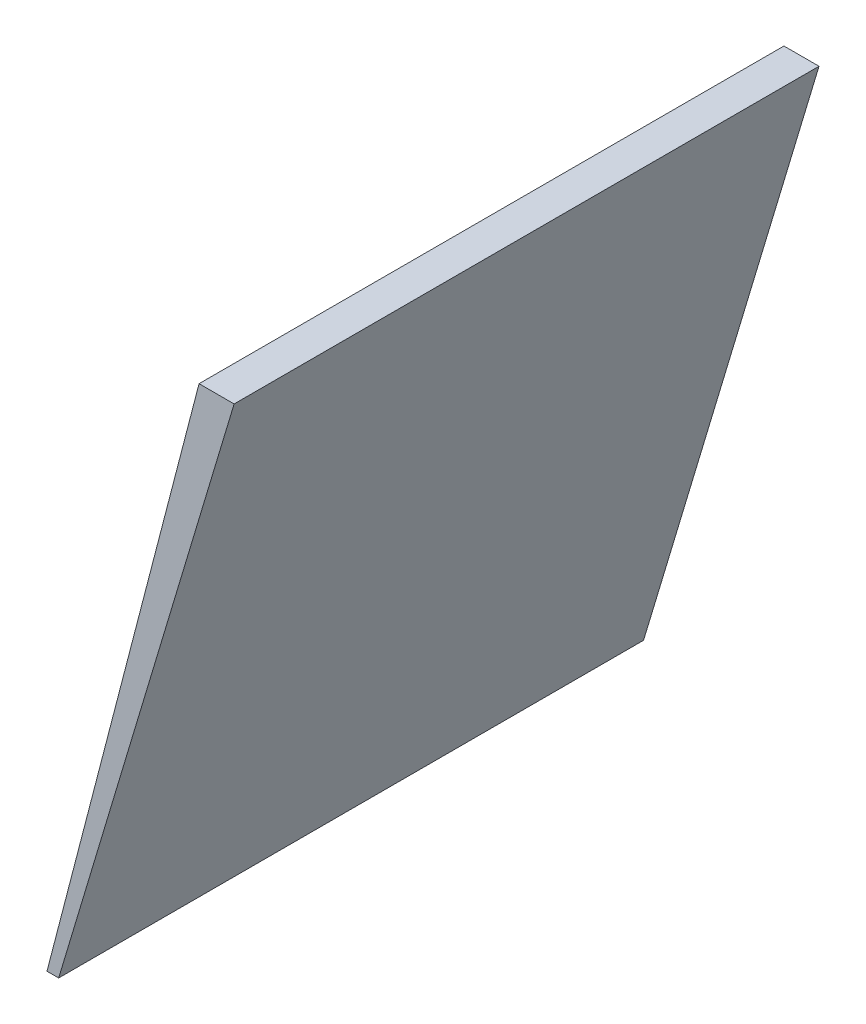
ISO-10303-21;
HEADER;
FILE_DESCRIPTION(('STEP AP214'),'2;1');
FILE_NAME('part.step','',(''),(''),'','','');
FILE_SCHEMA(('AUTOMOTIVE_DESIGN { 1 0 10303 214 1 1 1 1 }'));
ENDSEC;
DATA;
#1=APPLICATION_CONTEXT('core data for automotive mechanical design processes');
#2=APPLICATION_PROTOCOL_DEFINITION('international standard','automotive_design',2000,#1);
#3=PRODUCT_CONTEXT('',#1,'mechanical');
#4=PRODUCT('Part','Part','',(#3));
#5=PRODUCT_RELATED_PRODUCT_CATEGORY('part','',(#4));
#6=PRODUCT_DEFINITION_FORMATION('','',#4);
#7=PRODUCT_DEFINITION_CONTEXT('part definition',#1,'design');
#8=PRODUCT_DEFINITION('design','',#6,#7);
#9=PRODUCT_DEFINITION_SHAPE('','',#8);
#10=(LENGTH_UNIT() NAMED_UNIT(*) SI_UNIT(.MILLI.,.METRE.));
#11=(NAMED_UNIT(*) PLANE_ANGLE_UNIT() SI_UNIT($,.RADIAN.));
#12=(NAMED_UNIT(*) SI_UNIT($,.STERADIAN.) SOLID_ANGLE_UNIT());
#13=UNCERTAINTY_MEASURE_WITH_UNIT(LENGTH_MEASURE(1.E-05),#10,'distance_accuracy_value','');
#14=(GEOMETRIC_REPRESENTATION_CONTEXT(3) GLOBAL_UNCERTAINTY_ASSIGNED_CONTEXT((#13)) GLOBAL_UNIT_ASSIGNED_CONTEXT((#10,
#11,#12)) REPRESENTATION_CONTEXT('',''));
#15=CARTESIAN_POINT('',(0.,0.,0.));
#16=DIRECTION('',(0.,0.,1.));
#17=DIRECTION('',(1.,0.,0.));
#18=AXIS2_PLACEMENT_3D('',#15,#16,#17);
#19=CARTESIAN_POINT('',(-68.74209007364,-1.626384400547,-48.45331843764));
#20=DIRECTION('',(0.967822506789037,-0.25163385176201,0.));
#21=DIRECTION('',(0.25163385176201,0.967822506789037,0.));
#22=AXIS2_PLACEMENT_3D('',#19,#20,#21);
#23=PLANE('',#22);
#24=DIRECTION('',(0.,0.,-1.));
#25=VECTOR('',#24,1.);
#26=CARTESIAN_POINT('',(-68.74209007364,-1.626384400547,-47.92363973764));
#27=LINE('',#26,#25);
#28=CARTESIAN_POINT('',(-68.74209007364,-1.626384400547,-46.75331973764));
#29=VERTEX_POINT('',#28);
#30=CARTESIAN_POINT('',(-68.74209007364,-1.626384400547,-47.25331843764));
#31=VERTEX_POINT('',#30);
#32=EDGE_CURVE('E54',#29,#31,#27,.T.);
#33=ORIENTED_EDGE('',*,*,#32,.T.);
#34=DIRECTION('',(0.25163385174329,0.967822506793904,0.));
#35=VECTOR('',#34,1.);
#36=CARTESIAN_POINT('',(-68.87209007362,-2.126384400516,-47.25331843764));
#37=LINE('',#36,#35);
#38=CARTESIAN_POINT('',(-68.8720900736222,-2.12638440051668,-47.25331843764));
#39=VERTEX_POINT('',#38);
#40=EDGE_CURVE('E19',#39,#31,#37,.T.);
#41=ORIENTED_EDGE('',*,*,#40,.F.);
#42=DIRECTION('',(0.,0.,1.));
#43=VECTOR('',#42,1.);
#44=CARTESIAN_POINT('',(-68.87209007362,-2.126384400525,-44.48106509227));
#45=LINE('',#44,#43);
#46=CARTESIAN_POINT('',(-68.8720900736222,-2.12638440051469,-46.75331973764));
#47=VERTEX_POINT('',#46);
#48=EDGE_CURVE('E80',#39,#47,#45,.T.);
#49=ORIENTED_EDGE('',*,*,#48,.T.);
#50=DIRECTION('',(-0.251633851745176,-0.967822506793413,0.));
#51=VECTOR('',#50,1.);
#52=CARTESIAN_POINT('',(-68.74209007364,-1.626384400547,-46.75331973764));
#53=LINE('',#52,#51);
#54=EDGE_CURVE('E60',#29,#47,#53,.T.);
#55=ORIENTED_EDGE('',*,*,#54,.F.);
#56=EDGE_LOOP('',(#33,#41,#49,#55));
#57=FACE_BOUND('',#56,.T.);
#58=ADVANCED_FACE('F16',(#57),#23,.F.);
#59=CARTESIAN_POINT('',(0.,0.,-47.25331843764));
#60=DIRECTION('',(0.,0.,-1.));
#61=DIRECTION('',(-1.,0.,0.));
#62=AXIS2_PLACEMENT_3D('',#59,#60,#61);
#63=PLANE('',#62);
#64=DIRECTION('',(0.28734788556607,0.957826285221234,0.));
#65=VECTOR('',#64,1.);
#66=CARTESIAN_POINT('',(-68.72762590081,-1.678107019949,-47.25331843764));
#67=LINE('',#66,#65);
#68=CARTESIAN_POINT('',(-68.862109114972,-2.12638440051665,-47.25331843764));
#69=VERTEX_POINT('',#68);
#70=CARTESIAN_POINT('',(-68.7121091149822,-1.62638440054635,-47.25331843764));
#71=VERTEX_POINT('',#70);
#72=EDGE_CURVE('E82',#69,#71,#67,.T.);
#73=ORIENTED_EDGE('',*,*,#72,.F.);
#74=DIRECTION('',(1.,0.,0.));
#75=VECTOR('',#74,1.);
#76=CARTESIAN_POINT('',(-72.08658338126,-2.126384400525,-47.25331843764));
#77=LINE('',#76,#75);
#78=EDGE_CURVE('E67',#69,#39,#77,.F.);
#79=ORIENTED_EDGE('',*,*,#78,.T.);
#80=ORIENTED_EDGE('',*,*,#40,.T.);
#81=DIRECTION('',(1.,0.,0.));
#82=VECTOR('',#81,1.);
#83=CARTESIAN_POINT('',(-66.69522532924,-1.626384400547,-47.25331843764));
#84=LINE('',#83,#82);
#85=EDGE_CURVE('E62',#31,#71,#84,.T.);
#86=ORIENTED_EDGE('',*,*,#85,.T.);
#87=EDGE_LOOP('',(#73,#79,#80,#86));
#88=FACE_BOUND('',#87,.T.);
#89=ADVANCED_FACE('F64',(#88),#63,.T.);
#90=CARTESIAN_POINT('',(-66.69522532924,-1.626384400547,-47.92363973764));
#91=DIRECTION('',(0.,-1.,0.));
#92=DIRECTION('',(0.,0.,-1.));
#93=AXIS2_PLACEMENT_3D('',#90,#91,#92);
#94=PLANE('',#93);
#95=DIRECTION('',(0.,0.,1.));
#96=VECTOR('',#95,1.);
#97=CARTESIAN_POINT('',(-68.7121091149886,-1.62638440054441,-47.92363973764));
#98=LINE('',#97,#96);
#99=CARTESIAN_POINT('',(-68.7121091149847,-1.62638440054635,-46.75331973764));
#100=VERTEX_POINT('',#99);
#101=EDGE_CURVE('E71',#71,#100,#98,.T.);
#102=ORIENTED_EDGE('',*,*,#101,.F.);
#103=ORIENTED_EDGE('',*,*,#85,.F.);
#104=ORIENTED_EDGE('',*,*,#32,.F.);
#105=DIRECTION('',(1.,0.,0.));
#106=VECTOR('',#105,1.);
#107=CARTESIAN_POINT('',(-68.59999366419,-1.626384400547,-46.75331973764));
#108=LINE('',#107,#106);
#109=EDGE_CURVE('E73',#100,#29,#108,.F.);
#110=ORIENTED_EDGE('',*,*,#109,.F.);
#111=EDGE_LOOP('',(#102,#103,#104,#110));
#112=FACE_BOUND('',#111,.T.);
#113=ADVANCED_FACE('F69',(#112),#94,.F.);
#114=CARTESIAN_POINT('',(-68.59999366419,-2.201384400604,-46.75331973764));
#115=DIRECTION('',(0.,0.,1.));
#116=DIRECTION('',(1.,0.,0.));
#117=AXIS2_PLACEMENT_3D('',#114,#115,#116);
#118=PLANE('',#117);
#119=DIRECTION('',(1.,0.,0.));
#120=VECTOR('',#119,1.);
#121=CARTESIAN_POINT('',(-72.08658338126,-2.126384400525,-46.75331973764));
#122=LINE('',#121,#120);
#123=CARTESIAN_POINT('',(-68.862109114972,-2.12638440051465,-46.75331973764));
#124=VERTEX_POINT('',#123);
#125=EDGE_CURVE('E34',#47,#124,#122,.T.);
#126=ORIENTED_EDGE('',*,*,#125,.T.);
#127=DIRECTION('',(0.28734788556607,0.957826285221234,0.));
#128=VECTOR('',#127,1.);
#129=CARTESIAN_POINT('',(-68.72762590081,-1.678107019949,-46.75331973764));
#130=LINE('',#129,#128);
#131=EDGE_CURVE('E25',#100,#124,#130,.F.);
#132=ORIENTED_EDGE('',*,*,#131,.F.);
#133=ORIENTED_EDGE('',*,*,#109,.T.);
#134=ORIENTED_EDGE('',*,*,#54,.T.);
#135=EDGE_LOOP('',(#126,#132,#133,#134));
#136=FACE_BOUND('',#135,.T.);
#137=ADVANCED_FACE('F88',(#136),#118,.T.);
#138=CARTESIAN_POINT('',(-72.08658338126,-2.126384400525,-44.48106509227));
#139=DIRECTION('',(0.,1.,0.));
#140=DIRECTION('',(0.,0.,1.));
#141=AXIS2_PLACEMENT_3D('',#138,#139,#140);
#142=PLANE('',#141);
#143=ORIENTED_EDGE('',*,*,#78,.F.);
#144=DIRECTION('',(0.,0.,1.));
#145=VECTOR('',#144,1.);
#146=CARTESIAN_POINT('',(-68.862109114978,-2.12638440050959,-47.92363973764));
#147=LINE('',#146,#145);
#148=EDGE_CURVE('E11',#124,#69,#147,.F.);
#149=ORIENTED_EDGE('',*,*,#148,.F.);
#150=ORIENTED_EDGE('',*,*,#125,.F.);
#151=ORIENTED_EDGE('',*,*,#48,.F.);
#152=EDGE_LOOP('',(#143,#149,#150,#151));
#153=FACE_BOUND('',#152,.T.);
#154=ADVANCED_FACE('F90',(#153),#142,.F.);
#155=CARTESIAN_POINT('',(-68.72762590081,-1.678107019949,-47.92363973764));
#156=DIRECTION('',(0.957826285221234,-0.28734788556607,0.));
#157=DIRECTION('',(0.28734788556607,0.957826285221234,0.));
#158=AXIS2_PLACEMENT_3D('',#155,#156,#157);
#159=PLANE('',#158);
#160=ORIENTED_EDGE('',*,*,#131,.T.);
#161=ORIENTED_EDGE('',*,*,#148,.T.);
#162=ORIENTED_EDGE('',*,*,#72,.T.);
#163=ORIENTED_EDGE('',*,*,#101,.T.);
#164=EDGE_LOOP('',(#160,#161,#162,#163));
#165=FACE_BOUND('',#164,.T.);
#166=ADVANCED_FACE('F87',(#165),#159,.T.);
#167=CLOSED_SHELL('',(#58,#89,#113,#137,#154,#166));
#168=MANIFOLD_SOLID_BREP('B1',#167);
#169=ADVANCED_BREP_SHAPE_REPRESENTATION('',(#18,#168),#14);
#170=SHAPE_DEFINITION_REPRESENTATION(#9,#169);
ENDSEC;
END-ISO-10303-21;
